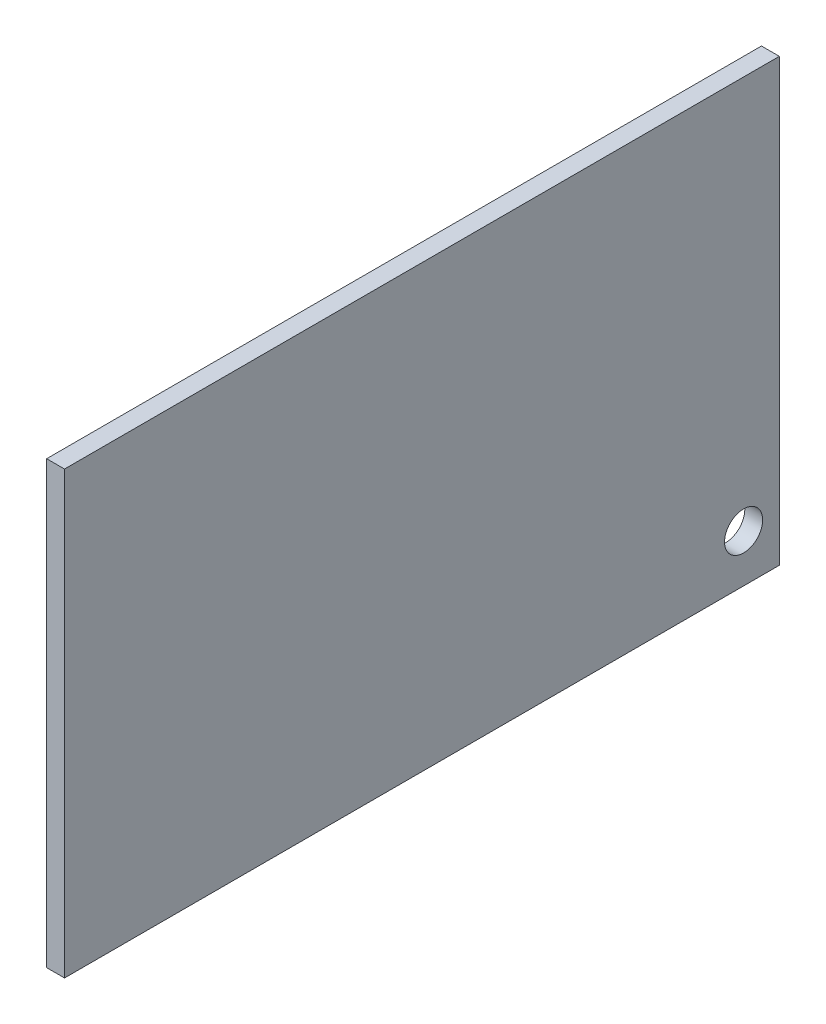
ISO-10303-21;
HEADER;
FILE_DESCRIPTION(('STEP AP214'),'2;1');
FILE_NAME('part.step','',(''),(''),'','','');
FILE_SCHEMA(('AUTOMOTIVE_DESIGN { 1 0 10303 214 1 1 1 1 }'));
ENDSEC;
DATA;
#1=APPLICATION_CONTEXT('core data for automotive mechanical design processes');
#2=APPLICATION_PROTOCOL_DEFINITION('international standard','automotive_design',2000,#1);
#3=PRODUCT_CONTEXT('',#1,'mechanical');
#4=PRODUCT('Part','Part','',(#3));
#5=PRODUCT_RELATED_PRODUCT_CATEGORY('part','',(#4));
#6=PRODUCT_DEFINITION_FORMATION('','',#4);
#7=PRODUCT_DEFINITION_CONTEXT('part definition',#1,'design');
#8=PRODUCT_DEFINITION('design','',#6,#7);
#9=PRODUCT_DEFINITION_SHAPE('','',#8);
#10=(LENGTH_UNIT() NAMED_UNIT(*) SI_UNIT(.MILLI.,.METRE.));
#11=(NAMED_UNIT(*) PLANE_ANGLE_UNIT() SI_UNIT($,.RADIAN.));
#12=(NAMED_UNIT(*) SI_UNIT($,.STERADIAN.) SOLID_ANGLE_UNIT());
#13=UNCERTAINTY_MEASURE_WITH_UNIT(LENGTH_MEASURE(1.E-05),#10,'distance_accuracy_value','');
#14=(GEOMETRIC_REPRESENTATION_CONTEXT(3) GLOBAL_UNCERTAINTY_ASSIGNED_CONTEXT((#13)) GLOBAL_UNIT_ASSIGNED_CONTEXT((#10,
#11,#12)) REPRESENTATION_CONTEXT('',''));
#15=CARTESIAN_POINT('',(0.,0.,0.));
#16=DIRECTION('',(0.,0.,1.));
#17=DIRECTION('',(1.,0.,0.));
#18=AXIS2_PLACEMENT_3D('',#15,#16,#17);
#19=CARTESIAN_POINT('',(1.5,0.,-84.9706562587964));
#20=DIRECTION('',(0.,1.,0.));
#21=DIRECTION('',(0.,0.,1.));
#22=AXIS2_PLACEMENT_3D('',#19,#20,#21);
#23=PLANE('',#22);
#24=DIRECTION('',(0.,0.,-1.));
#25=VECTOR('',#24,1.);
#26=CARTESIAN_POINT('',(0.,0.,-84.9706562587964));
#27=LINE('',#26,#25);
#28=CARTESIAN_POINT('',(0.,0.,0.));
#29=VERTEX_POINT('',#28);
#30=CARTESIAN_POINT('',(0.,0.,-60.));
#31=VERTEX_POINT('',#30);
#32=EDGE_CURVE('E100',#29,#31,#27,.T.);
#33=ORIENTED_EDGE('',*,*,#32,.T.);
#34=DIRECTION('',(-1.,0.,0.));
#35=VECTOR('',#34,1.);
#36=CARTESIAN_POINT('',(1.5,0.,-60.));
#37=LINE('',#36,#35);
#38=CARTESIAN_POINT('',(1.5,0.,-60.));
#39=VERTEX_POINT('',#38);
#40=EDGE_CURVE('E11',#39,#31,#37,.T.);
#41=ORIENTED_EDGE('',*,*,#40,.F.);
#42=DIRECTION('',(0.,0.,-1.));
#43=VECTOR('',#42,1.);
#44=CARTESIAN_POINT('',(1.5,0.,-84.9706562587964));
#45=LINE('',#44,#43);
#46=CARTESIAN_POINT('',(1.5,0.,0.));
#47=VERTEX_POINT('',#46);
#48=EDGE_CURVE('E83',#47,#39,#45,.T.);
#49=ORIENTED_EDGE('',*,*,#48,.F.);
#50=DIRECTION('',(-1.,0.,0.));
#51=VECTOR('',#50,1.);
#52=CARTESIAN_POINT('',(1.5,0.,0.));
#53=LINE('',#52,#51);
#54=EDGE_CURVE('E50',#47,#29,#53,.T.);
#55=ORIENTED_EDGE('',*,*,#54,.T.);
#56=EDGE_LOOP('',(#33,#41,#49,#55));
#57=FACE_BOUND('',#56,.T.);
#58=ADVANCED_FACE('F33',(#57),#23,.F.);
#59=CARTESIAN_POINT('',(1.5,18.5,-60.));
#60=DIRECTION('',(0.,0.,1.));
#61=DIRECTION('',(1.,0.,0.));
#62=AXIS2_PLACEMENT_3D('',#59,#60,#61);
#63=PLANE('',#62);
#64=DIRECTION('',(0.,1.,0.));
#65=VECTOR('',#64,1.);
#66=CARTESIAN_POINT('',(0.,18.5,-60.));
#67=LINE('',#66,#65);
#68=CARTESIAN_POINT('',(0.,37.,-60.));
#69=VERTEX_POINT('',#68);
#70=EDGE_CURVE('E88',#31,#69,#67,.T.);
#71=ORIENTED_EDGE('',*,*,#70,.T.);
#72=DIRECTION('',(-1.,0.,0.));
#73=VECTOR('',#72,1.);
#74=CARTESIAN_POINT('',(1.5,37.,-60.));
#75=LINE('',#74,#73);
#76=CARTESIAN_POINT('',(1.5,37.,-60.));
#77=VERTEX_POINT('',#76);
#78=EDGE_CURVE('E42',#77,#69,#75,.T.);
#79=ORIENTED_EDGE('',*,*,#78,.F.);
#80=DIRECTION('',(0.,1.,0.));
#81=VECTOR('',#80,1.);
#82=CARTESIAN_POINT('',(1.5,18.5,-60.));
#83=LINE('',#82,#81);
#84=EDGE_CURVE('E75',#39,#77,#83,.T.);
#85=ORIENTED_EDGE('',*,*,#84,.F.);
#86=ORIENTED_EDGE('',*,*,#40,.T.);
#87=EDGE_LOOP('',(#71,#79,#85,#86));
#88=FACE_BOUND('',#87,.T.);
#89=ADVANCED_FACE('F87',(#88),#63,.F.);
#90=CARTESIAN_POINT('',(1.5,37.,-84.9706562587964));
#91=DIRECTION('',(0.,1.,0.));
#92=DIRECTION('',(0.,0.,1.));
#93=AXIS2_PLACEMENT_3D('',#90,#91,#92);
#94=PLANE('',#93);
#95=DIRECTION('',(0.,0.,-1.));
#96=VECTOR('',#95,1.);
#97=CARTESIAN_POINT('',(0.,37.,-84.9706562587964));
#98=LINE('',#97,#96);
#99=CARTESIAN_POINT('',(0.,37.,0.));
#100=VERTEX_POINT('',#99);
#101=EDGE_CURVE('E103',#100,#69,#98,.T.);
#102=ORIENTED_EDGE('',*,*,#101,.F.);
#103=DIRECTION('',(-1.,0.,0.));
#104=VECTOR('',#103,1.);
#105=CARTESIAN_POINT('',(1.5,37.,0.));
#106=LINE('',#105,#104);
#107=CARTESIAN_POINT('',(1.5,37.,0.));
#108=VERTEX_POINT('',#107);
#109=EDGE_CURVE('E64',#108,#100,#106,.T.);
#110=ORIENTED_EDGE('',*,*,#109,.F.);
#111=DIRECTION('',(0.,0.,-1.));
#112=VECTOR('',#111,1.);
#113=CARTESIAN_POINT('',(1.5,37.,-84.9706562587964));
#114=LINE('',#113,#112);
#115=EDGE_CURVE('E82',#108,#77,#114,.T.);
#116=ORIENTED_EDGE('',*,*,#115,.T.);
#117=ORIENTED_EDGE('',*,*,#78,.T.);
#118=EDGE_LOOP('',(#102,#110,#116,#117));
#119=FACE_BOUND('',#118,.T.);
#120=ADVANCED_FACE('F91',(#119),#94,.T.);
#121=CARTESIAN_POINT('',(1.5,4.,-57.));
#122=DIRECTION('',(-1.,0.,0.));
#123=DIRECTION('',(0.,0.,1.));
#124=AXIS2_PLACEMENT_3D('',#121,#122,#123);
#125=CYLINDRICAL_SURFACE('',#124,1.6);
#126=CARTESIAN_POINT('',(1.5,4.,-57.));
#127=DIRECTION('',(1.,0.,0.));
#128=DIRECTION('',(0.,0.,-1.));
#129=AXIS2_PLACEMENT_3D('',#126,#127,#128);
#130=CIRCLE('',#129,1.6);
#131=CARTESIAN_POINT('',(1.5,4.,-58.6));
#132=VERTEX_POINT('',#131);
#133=EDGE_CURVE('E108',#132,#132,#130,.T.);
#134=ORIENTED_EDGE('',*,*,#133,.T.);
#135=EDGE_LOOP('',(#134));
#136=FACE_BOUND('',#135,.T.);
#137=CARTESIAN_POINT('',(0.,4.,-57.));
#138=DIRECTION('',(1.,0.,0.));
#139=DIRECTION('',(0.,0.,-1.));
#140=AXIS2_PLACEMENT_3D('',#137,#138,#139);
#141=CIRCLE('',#140,1.6);
#142=CARTESIAN_POINT('',(0.,4.,-58.6));
#143=VERTEX_POINT('',#142);
#144=EDGE_CURVE('E97',#143,#143,#141,.T.);
#145=ORIENTED_EDGE('',*,*,#144,.F.);
#146=EDGE_LOOP('',(#145));
#147=FACE_BOUND('',#146,.T.);
#148=ADVANCED_FACE('F35',(#136,#147),#125,.F.);
#149=CARTESIAN_POINT('',(1.5,18.5,0.));
#150=DIRECTION('',(0.,0.,1.));
#151=DIRECTION('',(1.,0.,0.));
#152=AXIS2_PLACEMENT_3D('',#149,#150,#151);
#153=PLANE('',#152);
#154=DIRECTION('',(0.,1.,0.));
#155=VECTOR('',#154,1.);
#156=CARTESIAN_POINT('',(0.,18.5,0.));
#157=LINE('',#156,#155);
#158=EDGE_CURVE('E105',#29,#100,#157,.T.);
#159=ORIENTED_EDGE('',*,*,#158,.F.);
#160=ORIENTED_EDGE('',*,*,#54,.F.);
#161=DIRECTION('',(0.,1.,0.));
#162=VECTOR('',#161,1.);
#163=CARTESIAN_POINT('',(1.5,18.5,0.));
#164=LINE('',#163,#162);
#165=EDGE_CURVE('E92',#47,#108,#164,.T.);
#166=ORIENTED_EDGE('',*,*,#165,.T.);
#167=ORIENTED_EDGE('',*,*,#109,.T.);
#168=EDGE_LOOP('',(#159,#160,#166,#167));
#169=FACE_BOUND('',#168,.T.);
#170=ADVANCED_FACE('F119',(#169),#153,.T.);
#171=CARTESIAN_POINT('',(1.5,18.5,-84.9706562587964));
#172=DIRECTION('',(1.,0.,0.));
#173=DIRECTION('',(0.,0.,-1.));
#174=AXIS2_PLACEMENT_3D('',#171,#172,#173);
#175=PLANE('',#174);
#176=ORIENTED_EDGE('',*,*,#133,.F.);
#177=EDGE_LOOP('',(#176));
#178=FACE_BOUND('',#177,.T.);
#179=ORIENTED_EDGE('',*,*,#48,.T.);
#180=ORIENTED_EDGE('',*,*,#84,.T.);
#181=ORIENTED_EDGE('',*,*,#115,.F.);
#182=ORIENTED_EDGE('',*,*,#165,.F.);
#183=EDGE_LOOP('',(#179,#180,#181,#182));
#184=FACE_BOUND('',#183,.T.);
#185=ADVANCED_FACE('F79',(#178,#184),#175,.T.);
#186=CARTESIAN_POINT('',(0.,18.5,-84.9706562587964));
#187=DIRECTION('',(1.,0.,0.));
#188=DIRECTION('',(0.,0.,-1.));
#189=AXIS2_PLACEMENT_3D('',#186,#187,#188);
#190=PLANE('',#189);
#191=ORIENTED_EDGE('',*,*,#144,.T.);
#192=EDGE_LOOP('',(#191));
#193=FACE_BOUND('',#192,.T.);
#194=ORIENTED_EDGE('',*,*,#32,.F.);
#195=ORIENTED_EDGE('',*,*,#158,.T.);
#196=ORIENTED_EDGE('',*,*,#101,.T.);
#197=ORIENTED_EDGE('',*,*,#70,.F.);
#198=EDGE_LOOP('',(#194,#195,#196,#197));
#199=FACE_BOUND('',#198,.T.);
#200=ADVANCED_FACE('F118',(#193,#199),#190,.F.);
#201=CLOSED_SHELL('',(#58,#89,#120,#148,#170,#185,#200));
#202=MANIFOLD_SOLID_BREP('B2',#201);
#203=ADVANCED_BREP_SHAPE_REPRESENTATION('',(#18,#202),#14);
#204=SHAPE_DEFINITION_REPRESENTATION(#9,#203);
ENDSEC;
END-ISO-10303-21;
